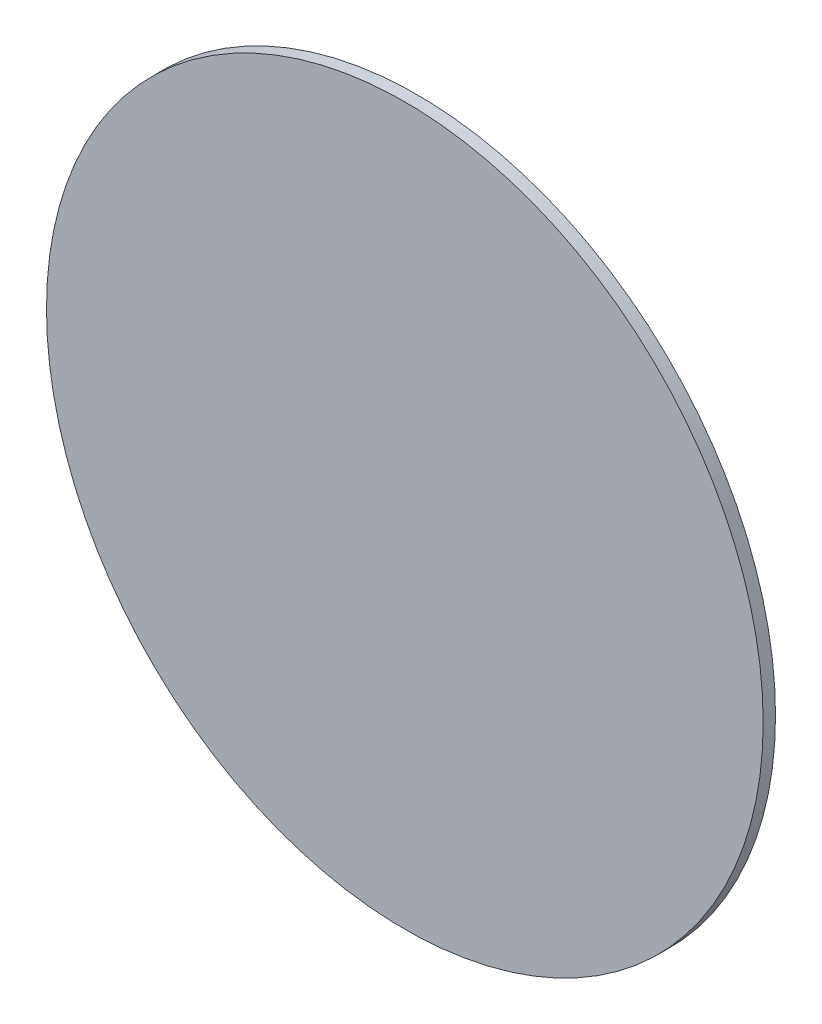
ISO-10303-21;
HEADER;
FILE_DESCRIPTION(('STEP AP214'),'2;1');
FILE_NAME('part.step','',(''),(''),'','','');
FILE_SCHEMA(('AUTOMOTIVE_DESIGN { 1 0 10303 214 1 1 1 1 }'));
ENDSEC;
DATA;
#1=APPLICATION_CONTEXT('core data for automotive mechanical design processes');
#2=APPLICATION_PROTOCOL_DEFINITION('international standard','automotive_design',2000,#1);
#3=PRODUCT_CONTEXT('',#1,'mechanical');
#4=PRODUCT('Part','Part','',(#3));
#5=PRODUCT_RELATED_PRODUCT_CATEGORY('part','',(#4));
#6=PRODUCT_DEFINITION_FORMATION('','',#4);
#7=PRODUCT_DEFINITION_CONTEXT('part definition',#1,'design');
#8=PRODUCT_DEFINITION('design','',#6,#7);
#9=PRODUCT_DEFINITION_SHAPE('','',#8);
#10=(LENGTH_UNIT() NAMED_UNIT(*) SI_UNIT(.MILLI.,.METRE.));
#11=(NAMED_UNIT(*) PLANE_ANGLE_UNIT() SI_UNIT($,.RADIAN.));
#12=(NAMED_UNIT(*) SI_UNIT($,.STERADIAN.) SOLID_ANGLE_UNIT());
#13=UNCERTAINTY_MEASURE_WITH_UNIT(LENGTH_MEASURE(1.E-05),#10,'distance_accuracy_value','');
#14=(GEOMETRIC_REPRESENTATION_CONTEXT(3) GLOBAL_UNCERTAINTY_ASSIGNED_CONTEXT((#13)) GLOBAL_UNIT_ASSIGNED_CONTEXT((#10,
#11,#12)) REPRESENTATION_CONTEXT('',''));
#15=CARTESIAN_POINT('',(0.,0.,0.));
#16=DIRECTION('',(0.,0.,1.));
#17=DIRECTION('',(1.,0.,0.));
#18=AXIS2_PLACEMENT_3D('',#15,#16,#17);
#19=CARTESIAN_POINT('',(1.2111452958838,0.785168282938262,0.));
#20=DIRECTION('',(0.,0.,1.));
#21=DIRECTION('',(1.,0.,0.));
#22=AXIS2_PLACEMENT_3D('',#19,#20,#21);
#23=CYLINDRICAL_SURFACE('',#22,0.0871797263137613);
#24=CARTESIAN_POINT('',(1.2111452958838,0.785168282938262,0.003));
#25=DIRECTION('',(0.,0.,1.));
#26=DIRECTION('',(1.,0.,0.));
#27=AXIS2_PLACEMENT_3D('',#24,#25,#26);
#28=CIRCLE('',#27,0.0871797263137613);
#29=CARTESIAN_POINT('',(1.2983250221976,0.785168282938262,0.003));
#30=VERTEX_POINT('',#29);
#31=CARTESIAN_POINT('',(1.1239655695701,0.785168282938262,0.003));
#32=VERTEX_POINT('',#31);
#33=EDGE_CURVE('E11',#30,#32,#28,.T.);
#34=ORIENTED_EDGE('',*,*,#33,.F.);
#35=CARTESIAN_POINT('',(1.2111452958838,0.785168282938262,0.003));
#36=DIRECTION('',(0.,0.,1.));
#37=DIRECTION('',(1.,0.,0.));
#38=AXIS2_PLACEMENT_3D('',#35,#36,#37);
#39=CIRCLE('',#38,0.0871797263137613);
#40=EDGE_CURVE('E24',#32,#30,#39,.T.);
#41=ORIENTED_EDGE('',*,*,#40,.F.);
#42=DIRECTION('',(0.,0.,-1.));
#43=VECTOR('',#42,1.);
#44=CARTESIAN_POINT('',(1.1239655695701,0.785168282938262,0.));
#45=LINE('',#44,#43);
#46=CARTESIAN_POINT('',(1.1239655695701,0.785168282938262,0.));
#47=VERTEX_POINT('',#46);
#48=EDGE_CURVE('E43',#32,#47,#45,.T.);
#49=ORIENTED_EDGE('',*,*,#48,.T.);
#50=CARTESIAN_POINT('',(1.2111452958838,0.785168282938262,0.));
#51=DIRECTION('',(0.,0.,1.));
#52=DIRECTION('',(1.,0.,0.));
#53=AXIS2_PLACEMENT_3D('',#50,#51,#52);
#54=CIRCLE('',#53,0.0871797263137613);
#55=CARTESIAN_POINT('',(1.2983250221976,0.785168282938262,0.));
#56=VERTEX_POINT('',#55);
#57=EDGE_CURVE('E40',#47,#56,#54,.T.);
#58=ORIENTED_EDGE('',*,*,#57,.T.);
#59=CARTESIAN_POINT('',(1.2111452958838,0.785168282938262,0.));
#60=DIRECTION('',(0.,0.,1.));
#61=DIRECTION('',(1.,0.,0.));
#62=AXIS2_PLACEMENT_3D('',#59,#60,#61);
#63=CIRCLE('',#62,0.0871797263137613);
#64=EDGE_CURVE('E42',#56,#47,#63,.T.);
#65=ORIENTED_EDGE('',*,*,#64,.T.);
#66=ORIENTED_EDGE('',*,*,#48,.F.);
#67=EDGE_LOOP('',(#34,#41,#49,#58,#65,#66));
#68=FACE_BOUND('',#67,.T.);
#69=ADVANCED_FACE('F17',(#68),#23,.T.);
#70=CARTESIAN_POINT('',(1.2111452958838,0.785168282938262,0.003));
#71=DIRECTION('',(0.,0.,1.));
#72=DIRECTION('',(1.,0.,0.));
#73=AXIS2_PLACEMENT_3D('',#70,#71,#72);
#74=PLANE('',#73);
#75=ORIENTED_EDGE('',*,*,#33,.T.);
#76=ORIENTED_EDGE('',*,*,#40,.T.);
#77=EDGE_LOOP('',(#75,#76));
#78=FACE_BOUND('',#77,.T.);
#79=ADVANCED_FACE('F49',(#78),#74,.T.);
#80=CARTESIAN_POINT('',(1.2111452958838,0.785168282938262,0.));
#81=DIRECTION('',(0.,0.,1.));
#82=DIRECTION('',(1.,0.,0.));
#83=AXIS2_PLACEMENT_3D('',#80,#81,#82);
#84=PLANE('',#83);
#85=ORIENTED_EDGE('',*,*,#64,.F.);
#86=ORIENTED_EDGE('',*,*,#57,.F.);
#87=EDGE_LOOP('',(#85,#86));
#88=FACE_BOUND('',#87,.T.);
#89=ADVANCED_FACE('F46',(#88),#84,.F.);
#90=CLOSED_SHELL('',(#69,#79,#89));
#91=MANIFOLD_SOLID_BREP('B1',#90);
#92=ADVANCED_BREP_SHAPE_REPRESENTATION('',(#18,#91),#14);
#93=SHAPE_DEFINITION_REPRESENTATION(#9,#92);
ENDSEC;
END-ISO-10303-21;
